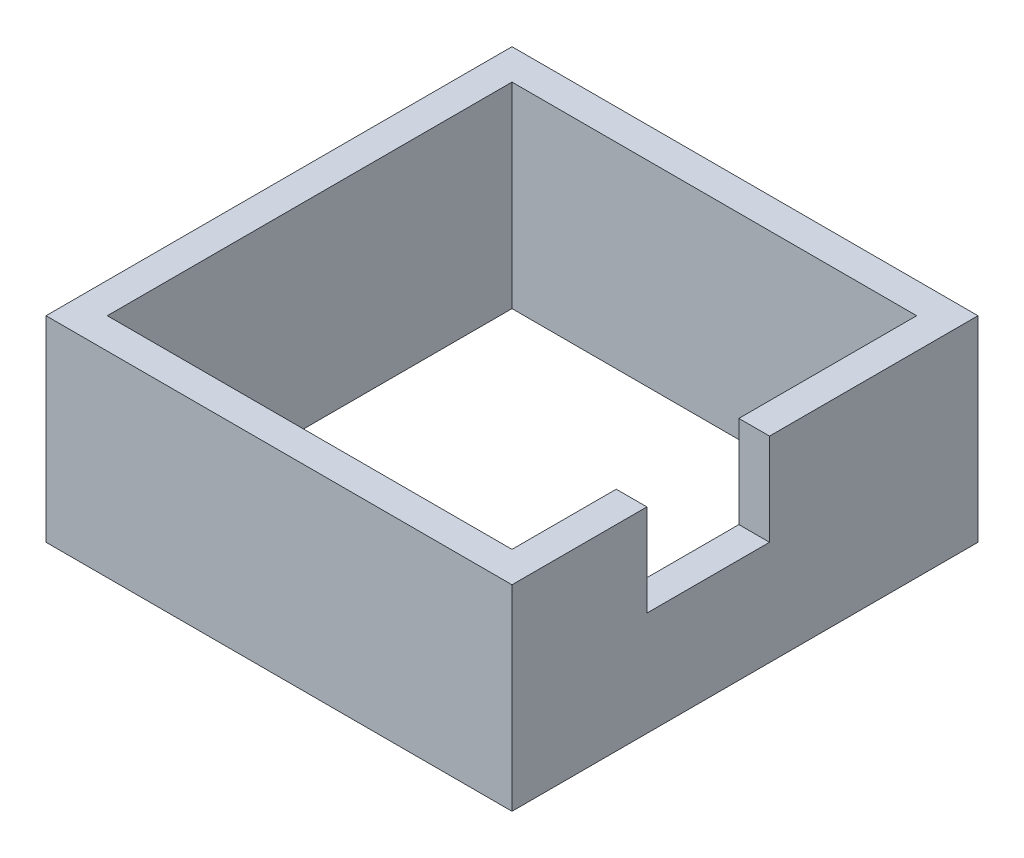
ISO-10303-21;
HEADER;
FILE_DESCRIPTION(('STEP AP214'),'2;1');
FILE_NAME('part.step','',(''),(''),'','','');
FILE_SCHEMA(('AUTOMOTIVE_DESIGN { 1 0 10303 214 1 1 1 1 }'));
ENDSEC;
DATA;
#1=APPLICATION_CONTEXT('core data for automotive mechanical design processes');
#2=APPLICATION_PROTOCOL_DEFINITION('international standard','automotive_design',2000,#1);
#3=PRODUCT_CONTEXT('',#1,'mechanical');
#4=PRODUCT('Part','Part','',(#3));
#5=PRODUCT_RELATED_PRODUCT_CATEGORY('part','',(#4));
#6=PRODUCT_DEFINITION_FORMATION('','',#4);
#7=PRODUCT_DEFINITION_CONTEXT('part definition',#1,'design');
#8=PRODUCT_DEFINITION('design','',#6,#7);
#9=PRODUCT_DEFINITION_SHAPE('','',#8);
#10=(LENGTH_UNIT() NAMED_UNIT(*) SI_UNIT(.MILLI.,.METRE.));
#11=(NAMED_UNIT(*) PLANE_ANGLE_UNIT() SI_UNIT($,.RADIAN.));
#12=(NAMED_UNIT(*) SI_UNIT($,.STERADIAN.) SOLID_ANGLE_UNIT());
#13=UNCERTAINTY_MEASURE_WITH_UNIT(LENGTH_MEASURE(1.E-05),#10,'distance_accuracy_value','');
#14=(GEOMETRIC_REPRESENTATION_CONTEXT(3) GLOBAL_UNCERTAINTY_ASSIGNED_CONTEXT((#13)) GLOBAL_UNIT_ASSIGNED_CONTEXT((#10,
#11,#12)) REPRESENTATION_CONTEXT('',''));
#15=CARTESIAN_POINT('',(0.,0.,0.));
#16=DIRECTION('',(0.,0.,1.));
#17=DIRECTION('',(1.,0.,0.));
#18=AXIS2_PLACEMENT_3D('',#15,#16,#17);
#19=CARTESIAN_POINT('',(0.,16.,0.));
#20=DIRECTION('',(0.,1.,0.));
#21=DIRECTION('',(0.,0.,1.));
#22=AXIS2_PLACEMENT_3D('',#19,#20,#21);
#23=PLANE('',#22);
#24=DIRECTION('',(1.,0.,0.));
#25=VECTOR('',#24,1.);
#26=CARTESIAN_POINT('',(4.,16.,-2.));
#27=LINE('',#26,#25);
#28=CARTESIAN_POINT('',(16.5,16.,-2.));
#29=VERTEX_POINT('',#28);
#30=CARTESIAN_POINT('',(19.,16.,-2.));
#31=VERTEX_POINT('',#30);
#32=EDGE_CURVE('E134',#29,#31,#27,.T.);
#33=ORIENTED_EDGE('',*,*,#32,.T.);
#34=DIRECTION('',(0.,0.,-1.));
#35=VECTOR('',#34,1.);
#36=CARTESIAN_POINT('',(19.,16.,-19.));
#37=LINE('',#36,#35);
#38=CARTESIAN_POINT('',(19.,16.,-19.));
#39=VERTEX_POINT('',#38);
#40=EDGE_CURVE('E219',#31,#39,#37,.T.);
#41=ORIENTED_EDGE('',*,*,#40,.T.);
#42=DIRECTION('',(-1.,0.,0.));
#43=VECTOR('',#42,1.);
#44=CARTESIAN_POINT('',(-19.,16.,-19.));
#45=LINE('',#44,#43);
#46=CARTESIAN_POINT('',(-19.,16.,-19.));
#47=VERTEX_POINT('',#46);
#48=EDGE_CURVE('E224',#39,#47,#45,.T.);
#49=ORIENTED_EDGE('',*,*,#48,.T.);
#50=DIRECTION('',(0.,0.,1.));
#51=VECTOR('',#50,1.);
#52=CARTESIAN_POINT('',(-19.,16.,-19.));
#53=LINE('',#52,#51);
#54=CARTESIAN_POINT('',(-19.,16.,19.));
#55=VERTEX_POINT('',#54);
#56=EDGE_CURVE('E211',#47,#55,#53,.T.);
#57=ORIENTED_EDGE('',*,*,#56,.T.);
#58=DIRECTION('',(1.,0.,0.));
#59=VECTOR('',#58,1.);
#60=CARTESIAN_POINT('',(-19.,16.,19.));
#61=LINE('',#60,#59);
#62=CARTESIAN_POINT('',(19.,16.,19.));
#63=VERTEX_POINT('',#62);
#64=EDGE_CURVE('E215',#55,#63,#61,.T.);
#65=ORIENTED_EDGE('',*,*,#64,.T.);
#66=CARTESIAN_POINT('',(19.,16.,8.));
#67=VERTEX_POINT('',#66);
#68=EDGE_CURVE('E220',#63,#67,#37,.T.);
#69=ORIENTED_EDGE('',*,*,#68,.T.);
#70=DIRECTION('',(1.,0.,0.));
#71=VECTOR('',#70,1.);
#72=CARTESIAN_POINT('',(4.,16.,8.));
#73=LINE('',#72,#71);
#74=CARTESIAN_POINT('',(16.5,16.,8.));
#75=VERTEX_POINT('',#74);
#76=EDGE_CURVE('E160',#75,#67,#73,.T.);
#77=ORIENTED_EDGE('',*,*,#76,.F.);
#78=DIRECTION('',(0.,0.,-1.));
#79=VECTOR('',#78,1.);
#80=CARTESIAN_POINT('',(16.5,16.,-16.5));
#81=LINE('',#80,#79);
#82=CARTESIAN_POINT('',(16.5,16.,16.5));
#83=VERTEX_POINT('',#82);
#84=EDGE_CURVE('E176',#83,#75,#81,.T.);
#85=ORIENTED_EDGE('',*,*,#84,.F.);
#86=DIRECTION('',(1.,0.,0.));
#87=VECTOR('',#86,1.);
#88=CARTESIAN_POINT('',(-16.5,16.,16.5));
#89=LINE('',#88,#87);
#90=CARTESIAN_POINT('',(-16.5,16.,16.5));
#91=VERTEX_POINT('',#90);
#92=EDGE_CURVE('E172',#91,#83,#89,.T.);
#93=ORIENTED_EDGE('',*,*,#92,.F.);
#94=DIRECTION('',(0.,0.,1.));
#95=VECTOR('',#94,1.);
#96=CARTESIAN_POINT('',(-16.5,16.,-16.5));
#97=LINE('',#96,#95);
#98=CARTESIAN_POINT('',(-16.5,16.,-16.5));
#99=VERTEX_POINT('',#98);
#100=EDGE_CURVE('E169',#99,#91,#97,.T.);
#101=ORIENTED_EDGE('',*,*,#100,.F.);
#102=DIRECTION('',(-1.,0.,0.));
#103=VECTOR('',#102,1.);
#104=CARTESIAN_POINT('',(-16.5,16.,-16.5));
#105=LINE('',#104,#103);
#106=CARTESIAN_POINT('',(16.5,16.,-16.5));
#107=VERTEX_POINT('',#106);
#108=EDGE_CURVE('E179',#107,#99,#105,.T.);
#109=ORIENTED_EDGE('',*,*,#108,.F.);
#110=EDGE_CURVE('E63',#29,#107,#81,.T.);
#111=ORIENTED_EDGE('',*,*,#110,.F.);
#112=EDGE_LOOP('',(#33,#41,#49,#57,#65,#69,#77,#85,#93,#101,#109,#111));
#113=FACE_BOUND('',#112,.T.);
#114=ADVANCED_FACE('F39',(#113),#23,.T.);
#115=CARTESIAN_POINT('',(0.,0.,0.));
#116=DIRECTION('',(0.,1.,0.));
#117=DIRECTION('',(0.,0.,1.));
#118=AXIS2_PLACEMENT_3D('',#115,#116,#117);
#119=PLANE('',#118);
#120=DIRECTION('',(0.,0.,1.));
#121=VECTOR('',#120,1.);
#122=CARTESIAN_POINT('',(-19.,0.,-19.));
#123=LINE('',#122,#121);
#124=CARTESIAN_POINT('',(-19.,0.,-19.));
#125=VERTEX_POINT('',#124);
#126=CARTESIAN_POINT('',(-19.,0.,19.));
#127=VERTEX_POINT('',#126);
#128=EDGE_CURVE('E210',#125,#127,#123,.T.);
#129=ORIENTED_EDGE('',*,*,#128,.F.);
#130=DIRECTION('',(-1.,0.,0.));
#131=VECTOR('',#130,1.);
#132=CARTESIAN_POINT('',(-19.,0.,-19.));
#133=LINE('',#132,#131);
#134=CARTESIAN_POINT('',(19.,0.,-19.));
#135=VERTEX_POINT('',#134);
#136=EDGE_CURVE('E216',#135,#125,#133,.T.);
#137=ORIENTED_EDGE('',*,*,#136,.F.);
#138=DIRECTION('',(0.,0.,-1.));
#139=VECTOR('',#138,1.);
#140=CARTESIAN_POINT('',(19.,0.,-19.));
#141=LINE('',#140,#139);
#142=CARTESIAN_POINT('',(19.,0.,19.));
#143=VERTEX_POINT('',#142);
#144=EDGE_CURVE('E234',#143,#135,#141,.T.);
#145=ORIENTED_EDGE('',*,*,#144,.F.);
#146=DIRECTION('',(1.,0.,0.));
#147=VECTOR('',#146,1.);
#148=CARTESIAN_POINT('',(-19.,0.,19.));
#149=LINE('',#148,#147);
#150=EDGE_CURVE('E231',#127,#143,#149,.T.);
#151=ORIENTED_EDGE('',*,*,#150,.F.);
#152=EDGE_LOOP('',(#129,#137,#145,#151));
#153=FACE_BOUND('',#152,.T.);
#154=DIRECTION('',(0.,0.,1.));
#155=VECTOR('',#154,1.);
#156=CARTESIAN_POINT('',(-16.5,0.,-16.5));
#157=LINE('',#156,#155);
#158=CARTESIAN_POINT('',(-16.5,0.,-16.5));
#159=VERTEX_POINT('',#158);
#160=CARTESIAN_POINT('',(-16.5,0.,16.5));
#161=VERTEX_POINT('',#160);
#162=EDGE_CURVE('E168',#159,#161,#157,.T.);
#163=ORIENTED_EDGE('',*,*,#162,.T.);
#164=DIRECTION('',(1.,0.,0.));
#165=VECTOR('',#164,1.);
#166=CARTESIAN_POINT('',(-16.5,0.,16.5));
#167=LINE('',#166,#165);
#168=CARTESIAN_POINT('',(16.5,0.,16.5));
#169=VERTEX_POINT('',#168);
#170=EDGE_CURVE('E186',#161,#169,#167,.T.);
#171=ORIENTED_EDGE('',*,*,#170,.T.);
#172=DIRECTION('',(0.,0.,-1.));
#173=VECTOR('',#172,1.);
#174=CARTESIAN_POINT('',(16.5,0.,-16.5));
#175=LINE('',#174,#173);
#176=CARTESIAN_POINT('',(16.5,0.,-16.5));
#177=VERTEX_POINT('',#176);
#178=EDGE_CURVE('E190',#169,#177,#175,.T.);
#179=ORIENTED_EDGE('',*,*,#178,.T.);
#180=DIRECTION('',(-1.,0.,0.));
#181=VECTOR('',#180,1.);
#182=CARTESIAN_POINT('',(-16.5,0.,-16.5));
#183=LINE('',#182,#181);
#184=EDGE_CURVE('E173',#177,#159,#183,.T.);
#185=ORIENTED_EDGE('',*,*,#184,.T.);
#186=EDGE_LOOP('',(#163,#171,#179,#185));
#187=FACE_BOUND('',#186,.T.);
#188=ADVANCED_FACE('F259',(#153,#187),#119,.F.);
#189=CARTESIAN_POINT('',(-19.,16.,-19.));
#190=DIRECTION('',(1.,0.,0.));
#191=DIRECTION('',(0.,0.,-1.));
#192=AXIS2_PLACEMENT_3D('',#189,#190,#191);
#193=PLANE('',#192);
#194=ORIENTED_EDGE('',*,*,#128,.T.);
#195=DIRECTION('',(0.,-1.,0.));
#196=VECTOR('',#195,1.);
#197=CARTESIAN_POINT('',(-19.,16.,19.));
#198=LINE('',#197,#196);
#199=EDGE_CURVE('E11',#55,#127,#198,.T.);
#200=ORIENTED_EDGE('',*,*,#199,.F.);
#201=ORIENTED_EDGE('',*,*,#56,.F.);
#202=DIRECTION('',(0.,-1.,0.));
#203=VECTOR('',#202,1.);
#204=CARTESIAN_POINT('',(-19.,16.,-19.));
#205=LINE('',#204,#203);
#206=EDGE_CURVE('E227',#47,#125,#205,.T.);
#207=ORIENTED_EDGE('',*,*,#206,.T.);
#208=EDGE_LOOP('',(#194,#200,#201,#207));
#209=FACE_BOUND('',#208,.T.);
#210=ADVANCED_FACE('F41',(#209),#193,.F.);
#211=CARTESIAN_POINT('',(-19.,16.,19.));
#212=DIRECTION('',(0.,0.,-1.));
#213=DIRECTION('',(-1.,0.,0.));
#214=AXIS2_PLACEMENT_3D('',#211,#212,#213);
#215=PLANE('',#214);
#216=ORIENTED_EDGE('',*,*,#150,.T.);
#217=DIRECTION('',(0.,-1.,0.));
#218=VECTOR('',#217,1.);
#219=CARTESIAN_POINT('',(19.,16.,19.));
#220=LINE('',#219,#218);
#221=EDGE_CURVE('E48',#63,#143,#220,.T.);
#222=ORIENTED_EDGE('',*,*,#221,.F.);
#223=ORIENTED_EDGE('',*,*,#64,.F.);
#224=ORIENTED_EDGE('',*,*,#199,.T.);
#225=EDGE_LOOP('',(#216,#222,#223,#224));
#226=FACE_BOUND('',#225,.T.);
#227=ADVANCED_FACE('F296',(#226),#215,.F.);
#228=CARTESIAN_POINT('',(19.,16.,-19.));
#229=DIRECTION('',(-1.,0.,0.));
#230=DIRECTION('',(0.,0.,1.));
#231=AXIS2_PLACEMENT_3D('',#228,#229,#230);
#232=PLANE('',#231);
#233=ORIENTED_EDGE('',*,*,#40,.F.);
#234=DIRECTION('',(0.,1.,0.));
#235=VECTOR('',#234,1.);
#236=CARTESIAN_POINT('',(19.,16.,-2.));
#237=LINE('',#236,#235);
#238=CARTESIAN_POINT('',(19.,8.5,-2.));
#239=VERTEX_POINT('',#238);
#240=EDGE_CURVE('E151',#239,#31,#237,.T.);
#241=ORIENTED_EDGE('',*,*,#240,.F.);
#242=DIRECTION('',(0.,0.,-1.));
#243=VECTOR('',#242,1.);
#244=CARTESIAN_POINT('',(19.,8.5,8.));
#245=LINE('',#244,#243);
#246=CARTESIAN_POINT('',(19.,8.5,8.));
#247=VERTEX_POINT('',#246);
#248=EDGE_CURVE('E143',#247,#239,#245,.T.);
#249=ORIENTED_EDGE('',*,*,#248,.F.);
#250=DIRECTION('',(0.,-1.,0.));
#251=VECTOR('',#250,1.);
#252=CARTESIAN_POINT('',(19.,16.,8.));
#253=LINE('',#252,#251);
#254=EDGE_CURVE('E157',#67,#247,#253,.T.);
#255=ORIENTED_EDGE('',*,*,#254,.F.);
#256=ORIENTED_EDGE('',*,*,#68,.F.);
#257=ORIENTED_EDGE('',*,*,#221,.T.);
#258=ORIENTED_EDGE('',*,*,#144,.T.);
#259=DIRECTION('',(0.,-1.,0.));
#260=VECTOR('',#259,1.);
#261=CARTESIAN_POINT('',(19.,16.,-19.));
#262=LINE('',#261,#260);
#263=EDGE_CURVE('E242',#39,#135,#262,.T.);
#264=ORIENTED_EDGE('',*,*,#263,.F.);
#265=EDGE_LOOP('',(#233,#241,#249,#255,#256,#257,#258,#264));
#266=FACE_BOUND('',#265,.T.);
#267=ADVANCED_FACE('F252',(#266),#232,.F.);
#268=CARTESIAN_POINT('',(-19.,16.,-19.));
#269=DIRECTION('',(0.,0.,1.));
#270=DIRECTION('',(1.,0.,0.));
#271=AXIS2_PLACEMENT_3D('',#268,#269,#270);
#272=PLANE('',#271);
#273=ORIENTED_EDGE('',*,*,#136,.T.);
#274=ORIENTED_EDGE('',*,*,#206,.F.);
#275=ORIENTED_EDGE('',*,*,#48,.F.);
#276=ORIENTED_EDGE('',*,*,#263,.T.);
#277=EDGE_LOOP('',(#273,#274,#275,#276));
#278=FACE_BOUND('',#277,.T.);
#279=ADVANCED_FACE('F263',(#278),#272,.F.);
#280=CARTESIAN_POINT('',(-16.5,16.,-16.5));
#281=DIRECTION('',(1.,0.,0.));
#282=DIRECTION('',(0.,0.,-1.));
#283=AXIS2_PLACEMENT_3D('',#280,#281,#282);
#284=PLANE('',#283);
#285=ORIENTED_EDGE('',*,*,#162,.F.);
#286=DIRECTION('',(0.,-1.,0.));
#287=VECTOR('',#286,1.);
#288=CARTESIAN_POINT('',(-16.5,16.,-16.5));
#289=LINE('',#288,#287);
#290=EDGE_CURVE('E182',#99,#159,#289,.T.);
#291=ORIENTED_EDGE('',*,*,#290,.F.);
#292=ORIENTED_EDGE('',*,*,#100,.T.);
#293=DIRECTION('',(0.,-1.,0.));
#294=VECTOR('',#293,1.);
#295=CARTESIAN_POINT('',(-16.5,16.,16.5));
#296=LINE('',#295,#294);
#297=EDGE_CURVE('E206',#91,#161,#296,.T.);
#298=ORIENTED_EDGE('',*,*,#297,.T.);
#299=EDGE_LOOP('',(#285,#291,#292,#298));
#300=FACE_BOUND('',#299,.T.);
#301=ADVANCED_FACE('F286',(#300),#284,.T.);
#302=CARTESIAN_POINT('',(-16.5,16.,16.5));
#303=DIRECTION('',(0.,0.,-1.));
#304=DIRECTION('',(-1.,0.,0.));
#305=AXIS2_PLACEMENT_3D('',#302,#303,#304);
#306=PLANE('',#305);
#307=ORIENTED_EDGE('',*,*,#170,.F.);
#308=ORIENTED_EDGE('',*,*,#297,.F.);
#309=ORIENTED_EDGE('',*,*,#92,.T.);
#310=DIRECTION('',(0.,-1.,0.));
#311=VECTOR('',#310,1.);
#312=CARTESIAN_POINT('',(16.5,16.,16.5));
#313=LINE('',#312,#311);
#314=EDGE_CURVE('E203',#83,#169,#313,.T.);
#315=ORIENTED_EDGE('',*,*,#314,.T.);
#316=EDGE_LOOP('',(#307,#308,#309,#315));
#317=FACE_BOUND('',#316,.T.);
#318=ADVANCED_FACE('F280',(#317),#306,.T.);
#319=CARTESIAN_POINT('',(16.5,16.,-16.5));
#320=DIRECTION('',(-1.,0.,0.));
#321=DIRECTION('',(0.,0.,1.));
#322=AXIS2_PLACEMENT_3D('',#319,#320,#321);
#323=PLANE('',#322);
#324=DIRECTION('',(0.,1.,0.));
#325=VECTOR('',#324,1.);
#326=CARTESIAN_POINT('',(16.5,16.,-2.));
#327=LINE('',#326,#325);
#328=CARTESIAN_POINT('',(16.5,8.5,-2.));
#329=VERTEX_POINT('',#328);
#330=EDGE_CURVE('E128',#329,#29,#327,.T.);
#331=ORIENTED_EDGE('',*,*,#330,.T.);
#332=ORIENTED_EDGE('',*,*,#110,.T.);
#333=DIRECTION('',(0.,-1.,0.));
#334=VECTOR('',#333,1.);
#335=CARTESIAN_POINT('',(16.5,16.,-16.5));
#336=LINE('',#335,#334);
#337=EDGE_CURVE('E200',#107,#177,#336,.T.);
#338=ORIENTED_EDGE('',*,*,#337,.T.);
#339=ORIENTED_EDGE('',*,*,#178,.F.);
#340=ORIENTED_EDGE('',*,*,#314,.F.);
#341=ORIENTED_EDGE('',*,*,#84,.T.);
#342=DIRECTION('',(0.,-1.,0.));
#343=VECTOR('',#342,1.);
#344=CARTESIAN_POINT('',(16.5,16.,8.));
#345=LINE('',#344,#343);
#346=CARTESIAN_POINT('',(16.5,8.5,8.));
#347=VERTEX_POINT('',#346);
#348=EDGE_CURVE('E149',#75,#347,#345,.T.);
#349=ORIENTED_EDGE('',*,*,#348,.T.);
#350=DIRECTION('',(0.,0.,-1.));
#351=VECTOR('',#350,1.);
#352=CARTESIAN_POINT('',(16.5,8.5,8.));
#353=LINE('',#352,#351);
#354=EDGE_CURVE('E140',#347,#329,#353,.T.);
#355=ORIENTED_EDGE('',*,*,#354,.T.);
#356=EDGE_LOOP('',(#331,#332,#338,#339,#340,#341,#349,#355));
#357=FACE_BOUND('',#356,.T.);
#358=ADVANCED_FACE('F147',(#357),#323,.T.);
#359=CARTESIAN_POINT('',(-16.5,16.,-16.5));
#360=DIRECTION('',(0.,0.,1.));
#361=DIRECTION('',(1.,0.,0.));
#362=AXIS2_PLACEMENT_3D('',#359,#360,#361);
#363=PLANE('',#362);
#364=ORIENTED_EDGE('',*,*,#184,.F.);
#365=ORIENTED_EDGE('',*,*,#337,.F.);
#366=ORIENTED_EDGE('',*,*,#108,.T.);
#367=ORIENTED_EDGE('',*,*,#290,.T.);
#368=EDGE_LOOP('',(#364,#365,#366,#367));
#369=FACE_BOUND('',#368,.T.);
#370=ADVANCED_FACE('F289',(#369),#363,.T.);
#371=CARTESIAN_POINT('',(4.,8.5,8.));
#372=DIRECTION('',(0.,-1.,0.));
#373=DIRECTION('',(0.,0.,-1.));
#374=AXIS2_PLACEMENT_3D('',#371,#372,#373);
#375=PLANE('',#374);
#376=DIRECTION('',(1.,0.,0.));
#377=VECTOR('',#376,1.);
#378=CARTESIAN_POINT('',(4.,8.5,8.));
#379=LINE('',#378,#377);
#380=EDGE_CURVE('E55',#347,#247,#379,.T.);
#381=ORIENTED_EDGE('',*,*,#380,.T.);
#382=ORIENTED_EDGE('',*,*,#248,.T.);
#383=DIRECTION('',(1.,0.,0.));
#384=VECTOR('',#383,1.);
#385=CARTESIAN_POINT('',(4.,8.5,-2.));
#386=LINE('',#385,#384);
#387=EDGE_CURVE('E131',#329,#239,#386,.T.);
#388=ORIENTED_EDGE('',*,*,#387,.F.);
#389=ORIENTED_EDGE('',*,*,#354,.F.);
#390=EDGE_LOOP('',(#381,#382,#388,#389));
#391=FACE_BOUND('',#390,.T.);
#392=ADVANCED_FACE('F139',(#391),#375,.F.);
#393=CARTESIAN_POINT('',(4.,16.,-2.));
#394=DIRECTION('',(0.,0.,-1.));
#395=DIRECTION('',(0.,1.,0.));
#396=AXIS2_PLACEMENT_3D('',#393,#394,#395);
#397=PLANE('',#396);
#398=ORIENTED_EDGE('',*,*,#387,.T.);
#399=ORIENTED_EDGE('',*,*,#240,.T.);
#400=ORIENTED_EDGE('',*,*,#32,.F.);
#401=ORIENTED_EDGE('',*,*,#330,.F.);
#402=EDGE_LOOP('',(#398,#399,#400,#401));
#403=FACE_BOUND('',#402,.T.);
#404=ADVANCED_FACE('F130',(#403),#397,.F.);
#405=CARTESIAN_POINT('',(4.,16.,8.));
#406=DIRECTION('',(0.,0.,1.));
#407=DIRECTION('',(0.,-1.,0.));
#408=AXIS2_PLACEMENT_3D('',#405,#406,#407);
#409=PLANE('',#408);
#410=ORIENTED_EDGE('',*,*,#76,.T.);
#411=ORIENTED_EDGE('',*,*,#254,.T.);
#412=ORIENTED_EDGE('',*,*,#380,.F.);
#413=ORIENTED_EDGE('',*,*,#348,.F.);
#414=EDGE_LOOP('',(#410,#411,#412,#413));
#415=FACE_BOUND('',#414,.T.);
#416=ADVANCED_FACE('F273',(#415),#409,.F.);
#417=CLOSED_SHELL('',(#114,#188,#210,#227,#267,#279,#301,#318,#358,#370,#392,#404,#416));
#418=MANIFOLD_SOLID_BREP('B2',#417);
#419=ADVANCED_BREP_SHAPE_REPRESENTATION('',(#18,#418),#14);
#420=SHAPE_DEFINITION_REPRESENTATION(#9,#419);
ENDSEC;
END-ISO-10303-21;
